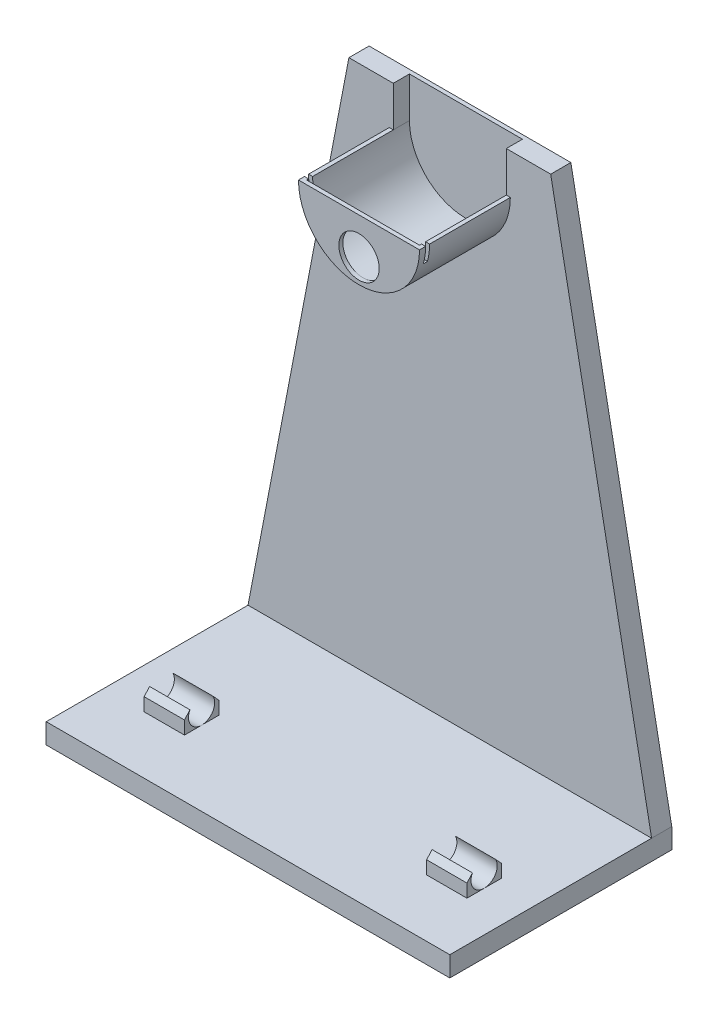
ISO-10303-21;
HEADER;
FILE_DESCRIPTION(('STEP AP214'),'2;1');
FILE_NAME('part.step','',(''),(''),'','','');
FILE_SCHEMA(('AUTOMOTIVE_DESIGN { 1 0 10303 214 1 1 1 1 }'));
ENDSEC;
DATA;
#1=APPLICATION_CONTEXT('core data for automotive mechanical design processes');
#2=APPLICATION_PROTOCOL_DEFINITION('international standard','automotive_design',2000,#1);
#3=PRODUCT_CONTEXT('',#1,'mechanical');
#4=PRODUCT('Part','Part','',(#3));
#5=PRODUCT_RELATED_PRODUCT_CATEGORY('part','',(#4));
#6=PRODUCT_DEFINITION_FORMATION('','',#4);
#7=PRODUCT_DEFINITION_CONTEXT('part definition',#1,'design');
#8=PRODUCT_DEFINITION('design','',#6,#7);
#9=PRODUCT_DEFINITION_SHAPE('','',#8);
#10=(LENGTH_UNIT() NAMED_UNIT(*) SI_UNIT(.MILLI.,.METRE.));
#11=(NAMED_UNIT(*) PLANE_ANGLE_UNIT() SI_UNIT($,.RADIAN.));
#12=(NAMED_UNIT(*) SI_UNIT($,.STERADIAN.) SOLID_ANGLE_UNIT());
#13=UNCERTAINTY_MEASURE_WITH_UNIT(LENGTH_MEASURE(1.E-05),#10,'distance_accuracy_value','');
#14=(GEOMETRIC_REPRESENTATION_CONTEXT(3) GLOBAL_UNCERTAINTY_ASSIGNED_CONTEXT((#13)) GLOBAL_UNIT_ASSIGNED_CONTEXT((#10,
#11,#12)) REPRESENTATION_CONTEXT('',''));
#15=CARTESIAN_POINT('',(0.,0.,0.));
#16=DIRECTION('',(0.,0.,1.));
#17=DIRECTION('',(1.,0.,0.));
#18=AXIS2_PLACEMENT_3D('',#15,#16,#17);
#19=CARTESIAN_POINT('',(-15.,120.,27.5));
#20=DIRECTION('',(0.,1.,0.));
#21=DIRECTION('',(0.,0.,1.));
#22=AXIS2_PLACEMENT_3D('',#19,#20,#21);
#23=PLANE('',#22);
#24=DIRECTION('',(-1.,0.,0.));
#25=VECTOR('',#24,1.);
#26=CARTESIAN_POINT('',(-20.1929042821755,120.,25.));
#27=LINE('',#26,#25);
#28=CARTESIAN_POINT('',(-14.,120.,25.));
#29=VERTEX_POINT('',#28);
#30=CARTESIAN_POINT('',(-15.,120.,25.));
#31=VERTEX_POINT('',#30);
#32=EDGE_CURVE('E442',#29,#31,#27,.T.);
#33=ORIENTED_EDGE('',*,*,#32,.F.);
#34=DIRECTION('',(0.,0.,-1.));
#35=VECTOR('',#34,1.);
#36=CARTESIAN_POINT('',(-14.,120.,26.5));
#37=LINE('',#36,#35);
#38=CARTESIAN_POINT('',(-14.,120.,5.));
#39=VERTEX_POINT('',#38);
#40=EDGE_CURVE('E522',#29,#39,#37,.T.);
#41=ORIENTED_EDGE('',*,*,#40,.T.);
#42=DIRECTION('',(1.,0.,0.));
#43=VECTOR('',#42,1.);
#44=CARTESIAN_POINT('',(-15.,120.,5.));
#45=LINE('',#44,#43);
#46=CARTESIAN_POINT('',(-15.,120.,5.));
#47=VERTEX_POINT('',#46);
#48=EDGE_CURVE('E548',#47,#39,#45,.T.);
#49=ORIENTED_EDGE('',*,*,#48,.F.);
#50=DIRECTION('',(0.,0.,-1.));
#51=VECTOR('',#50,1.);
#52=CARTESIAN_POINT('',(-15.,120.,27.5));
#53=LINE('',#52,#51);
#54=EDGE_CURVE('E552',#31,#47,#53,.T.);
#55=ORIENTED_EDGE('',*,*,#54,.F.);
#56=EDGE_LOOP('',(#33,#41,#49,#55));
#57=FACE_BOUND('',#56,.T.);
#58=ADVANCED_FACE('F45',(#57),#23,.T.);
#59=CARTESIAN_POINT('',(15.,120.,25.));
#60=VERTEX_POINT('',#59);
#61=CARTESIAN_POINT('',(14.,120.,25.));
#62=VERTEX_POINT('',#61);
#63=EDGE_CURVE('E445',#60,#62,#27,.T.);
#64=ORIENTED_EDGE('',*,*,#63,.F.);
#65=DIRECTION('',(0.,0.,-1.));
#66=VECTOR('',#65,1.);
#67=CARTESIAN_POINT('',(15.,120.,27.5));
#68=LINE('',#67,#66);
#69=CARTESIAN_POINT('',(15.,120.,5.));
#70=VERTEX_POINT('',#69);
#71=EDGE_CURVE('E564',#60,#70,#68,.T.);
#72=ORIENTED_EDGE('',*,*,#71,.T.);
#73=CARTESIAN_POINT('',(14.,120.,5.));
#74=VERTEX_POINT('',#73);
#75=EDGE_CURVE('E556',#74,#70,#45,.T.);
#76=ORIENTED_EDGE('',*,*,#75,.F.);
#77=DIRECTION('',(0.,0.,-1.));
#78=VECTOR('',#77,1.);
#79=CARTESIAN_POINT('',(14.,120.,26.5));
#80=LINE('',#79,#78);
#81=EDGE_CURVE('E535',#62,#74,#80,.T.);
#82=ORIENTED_EDGE('',*,*,#81,.F.);
#83=EDGE_LOOP('',(#64,#72,#76,#82));
#84=FACE_BOUND('',#83,.T.);
#85=ADVANCED_FACE('F728',(#84),#23,.T.);
#86=CARTESIAN_POINT('',(0.,0.,5.));
#87=DIRECTION('',(0.,0.,1.));
#88=DIRECTION('',(1.,0.,0.));
#89=AXIS2_PLACEMENT_3D('',#86,#87,#88);
#90=PLANE('',#89);
#91=DIRECTION('',(-0.188847393650124,-0.982006446980647,0.));
#92=VECTOR('',#91,1.);
#93=CARTESIAN_POINT('',(-25.,130.,5.));
#94=LINE('',#93,#92);
#95=CARTESIAN_POINT('',(-25.,130.,5.));
#96=VERTEX_POINT('',#95);
#97=CARTESIAN_POINT('',(-50.,0.,5.));
#98=VERTEX_POINT('',#97);
#99=EDGE_CURVE('E580',#96,#98,#94,.T.);
#100=ORIENTED_EDGE('',*,*,#99,.T.);
#101=DIRECTION('',(-1.,0.,0.));
#102=VECTOR('',#101,1.);
#103=CARTESIAN_POINT('',(50.,0.,5.));
#104=LINE('',#103,#102);
#105=CARTESIAN_POINT('',(50.,0.,5.));
#106=VERTEX_POINT('',#105);
#107=EDGE_CURVE('E477',#106,#98,#104,.T.);
#108=ORIENTED_EDGE('',*,*,#107,.F.);
#109=DIRECTION('',(-0.188847393650124,0.982006446980647,0.));
#110=VECTOR('',#109,1.);
#111=CARTESIAN_POINT('',(25.,130.,5.));
#112=LINE('',#111,#110);
#113=CARTESIAN_POINT('',(25.,130.,5.));
#114=VERTEX_POINT('',#113);
#115=EDGE_CURVE('E570',#106,#114,#112,.T.);
#116=ORIENTED_EDGE('',*,*,#115,.T.);
#117=DIRECTION('',(-1.,0.,0.));
#118=VECTOR('',#117,1.);
#119=CARTESIAN_POINT('',(25.,130.,5.));
#120=LINE('',#119,#118);
#121=CARTESIAN_POINT('',(14.,130.,5.));
#122=VERTEX_POINT('',#121);
#123=EDGE_CURVE('E576',#114,#122,#120,.T.);
#124=ORIENTED_EDGE('',*,*,#123,.T.);
#125=DIRECTION('',(0.,-1.,0.));
#126=VECTOR('',#125,1.);
#127=CARTESIAN_POINT('',(14.,0.,5.));
#128=LINE('',#127,#126);
#129=EDGE_CURVE('E539',#122,#74,#128,.T.);
#130=ORIENTED_EDGE('',*,*,#129,.T.);
#131=ORIENTED_EDGE('',*,*,#75,.T.);
#132=CARTESIAN_POINT('',(0.,120.,5.));
#133=DIRECTION('',(0.,0.,1.));
#134=DIRECTION('',(1.,0.,0.));
#135=AXIS2_PLACEMENT_3D('',#132,#133,#134);
#136=CIRCLE('',#135,15.);
#137=EDGE_CURVE('E543',#47,#70,#136,.T.);
#138=ORIENTED_EDGE('',*,*,#137,.F.);
#139=ORIENTED_EDGE('',*,*,#48,.T.);
#140=DIRECTION('',(0.,1.,0.));
#141=VECTOR('',#140,1.);
#142=CARTESIAN_POINT('',(-14.,0.,5.));
#143=LINE('',#142,#141);
#144=CARTESIAN_POINT('',(-14.,130.,5.));
#145=VERTEX_POINT('',#144);
#146=EDGE_CURVE('E534',#39,#145,#143,.T.);
#147=ORIENTED_EDGE('',*,*,#146,.T.);
#148=EDGE_CURVE('E574',#145,#96,#120,.T.);
#149=ORIENTED_EDGE('',*,*,#148,.T.);
#150=EDGE_LOOP('',(#100,#108,#116,#124,#130,#131,#138,#139,#147,#149));
#151=FACE_BOUND('',#150,.T.);
#152=ADVANCED_FACE('F735',(#151),#90,.T.);
#153=CARTESIAN_POINT('',(25.,130.,5.));
#154=DIRECTION('',(0.,-1.,0.));
#155=DIRECTION('',(1.,0.,0.));
#156=AXIS2_PLACEMENT_3D('',#153,#154,#155);
#157=PLANE('',#156);
#158=DIRECTION('',(0.,0.,-1.));
#159=VECTOR('',#158,1.);
#160=CARTESIAN_POINT('',(14.,130.,26.5));
#161=LINE('',#160,#159);
#162=CARTESIAN_POINT('',(14.,130.,1.));
#163=VERTEX_POINT('',#162);
#164=EDGE_CURVE('E526',#122,#163,#161,.T.);
#165=ORIENTED_EDGE('',*,*,#164,.F.);
#166=ORIENTED_EDGE('',*,*,#123,.F.);
#167=DIRECTION('',(0.,0.,-1.));
#168=VECTOR('',#167,1.);
#169=CARTESIAN_POINT('',(25.,130.,5.));
#170=LINE('',#169,#168);
#171=CARTESIAN_POINT('',(25.,130.,0.));
#172=VERTEX_POINT('',#171);
#173=EDGE_CURVE('E621',#114,#172,#170,.T.);
#174=ORIENTED_EDGE('',*,*,#173,.T.);
#175=DIRECTION('',(-1.,0.,0.));
#176=VECTOR('',#175,1.);
#177=CARTESIAN_POINT('',(25.,130.,0.));
#178=LINE('',#177,#176);
#179=CARTESIAN_POINT('',(-25.,130.,0.));
#180=VERTEX_POINT('',#179);
#181=EDGE_CURVE('E588',#172,#180,#178,.T.);
#182=ORIENTED_EDGE('',*,*,#181,.T.);
#183=DIRECTION('',(0.,0.,-1.));
#184=VECTOR('',#183,1.);
#185=CARTESIAN_POINT('',(-25.,130.,5.));
#186=LINE('',#185,#184);
#187=EDGE_CURVE('E617',#96,#180,#186,.T.);
#188=ORIENTED_EDGE('',*,*,#187,.F.);
#189=ORIENTED_EDGE('',*,*,#148,.F.);
#190=DIRECTION('',(0.,0.,-1.));
#191=VECTOR('',#190,1.);
#192=CARTESIAN_POINT('',(-14.,130.,26.5));
#193=LINE('',#192,#191);
#194=CARTESIAN_POINT('',(-14.,130.,1.));
#195=VERTEX_POINT('',#194);
#196=EDGE_CURVE('E521',#145,#195,#193,.T.);
#197=ORIENTED_EDGE('',*,*,#196,.T.);
#198=DIRECTION('',(-1.,0.,0.));
#199=VECTOR('',#198,1.);
#200=CARTESIAN_POINT('',(-14.,130.,1.));
#201=LINE('',#200,#199);
#202=EDGE_CURVE('E504',#163,#195,#201,.T.);
#203=ORIENTED_EDGE('',*,*,#202,.F.);
#204=EDGE_LOOP('',(#165,#166,#174,#182,#188,#189,#197,#203));
#205=FACE_BOUND('',#204,.T.);
#206=ADVANCED_FACE('F740',(#205),#157,.F.);
#207=DIRECTION('',(1.,0.,0.));
#208=VECTOR('',#207,1.);
#209=CARTESIAN_POINT('',(21.4474135279385,120.,26.));
#210=LINE('',#209,#208);
#211=CARTESIAN_POINT('',(-15.,120.,26.));
#212=VERTEX_POINT('',#211);
#213=CARTESIAN_POINT('',(-14.,120.,26.));
#214=VERTEX_POINT('',#213);
#215=EDGE_CURVE('E436',#212,#214,#210,.T.);
#216=ORIENTED_EDGE('',*,*,#215,.F.);
#217=CARTESIAN_POINT('',(-15.,120.,27.5));
#218=VERTEX_POINT('',#217);
#219=EDGE_CURVE('E560',#218,#212,#53,.T.);
#220=ORIENTED_EDGE('',*,*,#219,.F.);
#221=DIRECTION('',(1.,0.,0.));
#222=VECTOR('',#221,1.);
#223=CARTESIAN_POINT('',(-15.,120.,27.5));
#224=LINE('',#223,#222);
#225=CARTESIAN_POINT('',(15.,120.,27.5));
#226=VERTEX_POINT('',#225);
#227=EDGE_CURVE('E547',#218,#226,#224,.T.);
#228=ORIENTED_EDGE('',*,*,#227,.T.);
#229=CARTESIAN_POINT('',(15.,120.,26.));
#230=VERTEX_POINT('',#229);
#231=EDGE_CURVE('E565',#226,#230,#68,.T.);
#232=ORIENTED_EDGE('',*,*,#231,.T.);
#233=CARTESIAN_POINT('',(14.,120.,26.));
#234=VERTEX_POINT('',#233);
#235=EDGE_CURVE('E446',#234,#230,#210,.T.);
#236=ORIENTED_EDGE('',*,*,#235,.F.);
#237=CARTESIAN_POINT('',(14.,120.,26.5));
#238=VERTEX_POINT('',#237);
#239=EDGE_CURVE('E530',#238,#234,#80,.T.);
#240=ORIENTED_EDGE('',*,*,#239,.F.);
#241=DIRECTION('',(1.,0.,0.));
#242=VECTOR('',#241,1.);
#243=CARTESIAN_POINT('',(-15.,120.,26.5));
#244=LINE('',#243,#242);
#245=CARTESIAN_POINT('',(-14.,120.,26.5));
#246=VERTEX_POINT('',#245);
#247=EDGE_CURVE('E625',#246,#238,#244,.T.);
#248=ORIENTED_EDGE('',*,*,#247,.F.);
#249=EDGE_CURVE('E517',#246,#214,#37,.T.);
#250=ORIENTED_EDGE('',*,*,#249,.T.);
#251=EDGE_LOOP('',(#216,#220,#228,#232,#236,#240,#248,#250));
#252=FACE_BOUND('',#251,.T.);
#253=ADVANCED_FACE('F730',(#252),#23,.T.);
#254=CARTESIAN_POINT('',(25.,130.,5.));
#255=DIRECTION('',(-0.982006446980647,-0.188847393650124,0.));
#256=DIRECTION('',(0.188847393650124,-0.982006446980648,0.));
#257=AXIS2_PLACEMENT_3D('',#254,#255,#256);
#258=PLANE('',#257);
#259=DIRECTION('',(-0.188847393650124,0.982006446980647,0.));
#260=VECTOR('',#259,1.);
#261=CARTESIAN_POINT('',(25.,130.,0.));
#262=LINE('',#261,#260);
#263=CARTESIAN_POINT('',(50.,0.,0.));
#264=VERTEX_POINT('',#263);
#265=EDGE_CURVE('E569',#264,#172,#262,.T.);
#266=ORIENTED_EDGE('',*,*,#265,.T.);
#267=ORIENTED_EDGE('',*,*,#173,.F.);
#268=ORIENTED_EDGE('',*,*,#115,.F.);
#269=DIRECTION('',(0.,0.,-1.));
#270=VECTOR('',#269,1.);
#271=CARTESIAN_POINT('',(50.,0.,5.));
#272=LINE('',#271,#270);
#273=EDGE_CURVE('E584',#106,#264,#272,.T.);
#274=ORIENTED_EDGE('',*,*,#273,.T.);
#275=EDGE_LOOP('',(#266,#267,#268,#274));
#276=FACE_BOUND('',#275,.T.);
#277=ADVANCED_FACE('F47',(#276),#258,.F.);
#278=CARTESIAN_POINT('',(-25.,130.,5.));
#279=DIRECTION('',(0.982006446980647,-0.188847393650124,0.));
#280=DIRECTION('',(0.188847393650124,0.982006446980648,0.));
#281=AXIS2_PLACEMENT_3D('',#278,#279,#280);
#282=PLANE('',#281);
#283=DIRECTION('',(-0.188847393650124,-0.982006446980647,0.));
#284=VECTOR('',#283,1.);
#285=CARTESIAN_POINT('',(-25.,130.,0.));
#286=LINE('',#285,#284);
#287=CARTESIAN_POINT('',(-50.,0.,0.));
#288=VERTEX_POINT('',#287);
#289=EDGE_CURVE('E591',#180,#288,#286,.T.);
#290=ORIENTED_EDGE('',*,*,#289,.T.);
#291=DIRECTION('',(0.,0.,-1.));
#292=VECTOR('',#291,1.);
#293=CARTESIAN_POINT('',(-50.,0.,5.));
#294=LINE('',#293,#292);
#295=EDGE_CURVE('E613',#98,#288,#294,.T.);
#296=ORIENTED_EDGE('',*,*,#295,.F.);
#297=ORIENTED_EDGE('',*,*,#99,.F.);
#298=ORIENTED_EDGE('',*,*,#187,.T.);
#299=EDGE_LOOP('',(#290,#296,#297,#298));
#300=FACE_BOUND('',#299,.T.);
#301=ADVANCED_FACE('F746',(#300),#282,.F.);
#302=CARTESIAN_POINT('',(-50.,0.,5.));
#303=DIRECTION('',(1.,0.,0.));
#304=DIRECTION('',(0.,0.,-1.));
#305=AXIS2_PLACEMENT_3D('',#302,#303,#304);
#306=PLANE('',#305);
#307=DIRECTION('',(0.,-1.,0.));
#308=VECTOR('',#307,1.);
#309=CARTESIAN_POINT('',(-50.,0.,0.));
#310=LINE('',#309,#308);
#311=CARTESIAN_POINT('',(-50.,-5.,0.));
#312=VERTEX_POINT('',#311);
#313=EDGE_CURVE('E594',#288,#312,#310,.T.);
#314=ORIENTED_EDGE('',*,*,#313,.T.);
#315=DIRECTION('',(0.,0.,-1.));
#316=VECTOR('',#315,1.);
#317=CARTESIAN_POINT('',(-50.,-5.,5.));
#318=LINE('',#317,#316);
#319=CARTESIAN_POINT('',(-50.,-5.,55.));
#320=VERTEX_POINT('',#319);
#321=EDGE_CURVE('E609',#320,#312,#318,.T.);
#322=ORIENTED_EDGE('',*,*,#321,.F.);
#323=DIRECTION('',(0.,-1.,0.));
#324=VECTOR('',#323,1.);
#325=CARTESIAN_POINT('',(-50.,0.,55.));
#326=LINE('',#325,#324);
#327=CARTESIAN_POINT('',(-50.,0.,55.));
#328=VERTEX_POINT('',#327);
#329=EDGE_CURVE('E472',#328,#320,#326,.T.);
#330=ORIENTED_EDGE('',*,*,#329,.F.);
#331=DIRECTION('',(0.,0.,-1.));
#332=VECTOR('',#331,1.);
#333=CARTESIAN_POINT('',(-50.,0.,55.));
#334=LINE('',#333,#332);
#335=EDGE_CURVE('E486',#328,#98,#334,.T.);
#336=ORIENTED_EDGE('',*,*,#335,.T.);
#337=ORIENTED_EDGE('',*,*,#295,.T.);
#338=EDGE_LOOP('',(#314,#322,#330,#336,#337));
#339=FACE_BOUND('',#338,.T.);
#340=ADVANCED_FACE('F823',(#339),#306,.F.);
#341=CARTESIAN_POINT('',(-50.,-5.,5.));
#342=DIRECTION('',(0.,1.,0.));
#343=DIRECTION('',(0.,0.,1.));
#344=AXIS2_PLACEMENT_3D('',#341,#342,#343);
#345=PLANE('',#344);
#346=DIRECTION('',(0.,0.,-1.));
#347=VECTOR('',#346,1.);
#348=CARTESIAN_POINT('',(50.,-5.,5.));
#349=LINE('',#348,#347);
#350=CARTESIAN_POINT('',(50.,-5.,55.));
#351=VERTEX_POINT('',#350);
#352=CARTESIAN_POINT('',(50.,-5.,0.));
#353=VERTEX_POINT('',#352);
#354=EDGE_CURVE('E605',#351,#353,#349,.T.);
#355=ORIENTED_EDGE('',*,*,#354,.F.);
#356=DIRECTION('',(1.,0.,0.));
#357=VECTOR('',#356,1.);
#358=CARTESIAN_POINT('',(-50.,-5.,55.));
#359=LINE('',#358,#357);
#360=EDGE_CURVE('E476',#320,#351,#359,.T.);
#361=ORIENTED_EDGE('',*,*,#360,.F.);
#362=ORIENTED_EDGE('',*,*,#321,.T.);
#363=DIRECTION('',(1.,0.,0.));
#364=VECTOR('',#363,1.);
#365=CARTESIAN_POINT('',(-50.,-5.,0.));
#366=LINE('',#365,#364);
#367=EDGE_CURVE('E597',#312,#353,#366,.T.);
#368=ORIENTED_EDGE('',*,*,#367,.T.);
#369=EDGE_LOOP('',(#355,#361,#362,#368));
#370=FACE_BOUND('',#369,.T.);
#371=ADVANCED_FACE('F819',(#370),#345,.F.);
#372=CARTESIAN_POINT('',(50.,0.,5.));
#373=DIRECTION('',(-1.,0.,0.));
#374=DIRECTION('',(0.,0.,1.));
#375=AXIS2_PLACEMENT_3D('',#372,#373,#374);
#376=PLANE('',#375);
#377=DIRECTION('',(0.,1.,0.));
#378=VECTOR('',#377,1.);
#379=CARTESIAN_POINT('',(50.,0.,0.));
#380=LINE('',#379,#378);
#381=EDGE_CURVE('E575',#353,#264,#380,.T.);
#382=ORIENTED_EDGE('',*,*,#381,.T.);
#383=ORIENTED_EDGE('',*,*,#273,.F.);
#384=DIRECTION('',(0.,0.,-1.));
#385=VECTOR('',#384,1.);
#386=CARTESIAN_POINT('',(50.,0.,55.));
#387=LINE('',#386,#385);
#388=CARTESIAN_POINT('',(50.,0.,55.));
#389=VERTEX_POINT('',#388);
#390=EDGE_CURVE('E492',#389,#106,#387,.T.);
#391=ORIENTED_EDGE('',*,*,#390,.F.);
#392=DIRECTION('',(0.,1.,0.));
#393=VECTOR('',#392,1.);
#394=CARTESIAN_POINT('',(50.,-5.,55.));
#395=LINE('',#394,#393);
#396=EDGE_CURVE('E480',#351,#389,#395,.T.);
#397=ORIENTED_EDGE('',*,*,#396,.F.);
#398=ORIENTED_EDGE('',*,*,#354,.T.);
#399=EDGE_LOOP('',(#382,#383,#391,#397,#398));
#400=FACE_BOUND('',#399,.T.);
#401=ADVANCED_FACE('F811',(#400),#376,.F.);
#402=CARTESIAN_POINT('',(0.,0.,0.));
#403=DIRECTION('',(0.,0.,1.));
#404=DIRECTION('',(1.,0.,0.));
#405=AXIS2_PLACEMENT_3D('',#402,#403,#404);
#406=PLANE('',#405);
#407=ORIENTED_EDGE('',*,*,#381,.F.);
#408=ORIENTED_EDGE('',*,*,#367,.F.);
#409=ORIENTED_EDGE('',*,*,#313,.F.);
#410=ORIENTED_EDGE('',*,*,#289,.F.);
#411=ORIENTED_EDGE('',*,*,#181,.F.);
#412=ORIENTED_EDGE('',*,*,#265,.F.);
#413=EDGE_LOOP('',(#407,#408,#409,#410,#411,#412));
#414=FACE_BOUND('',#413,.T.);
#415=ADVANCED_FACE('F806',(#414),#406,.F.);
#416=CARTESIAN_POINT('',(0.,120.,27.5));
#417=DIRECTION('',(0.,0.,-1.));
#418=DIRECTION('',(-1.,0.,0.));
#419=AXIS2_PLACEMENT_3D('',#416,#417,#418);
#420=CYLINDRICAL_SURFACE('',#419,15.);
#421=DIRECTION('',(0.,0.,-1.));
#422=VECTOR('',#421,1.);
#423=CARTESIAN_POINT('',(-14.456832294801,116.,27.5));
#424=LINE('',#423,#422);
#425=CARTESIAN_POINT('',(-14.456832294801,116.,26.));
#426=VERTEX_POINT('',#425);
#427=CARTESIAN_POINT('',(-14.456832294801,116.,25.));
#428=VERTEX_POINT('',#427);
#429=EDGE_CURVE('E453',#426,#428,#424,.T.);
#430=ORIENTED_EDGE('',*,*,#429,.T.);
#431=CARTESIAN_POINT('',(0.,120.,25.));
#432=DIRECTION('',(0.,0.,-1.));
#433=DIRECTION('',(-1.,0.,0.));
#434=AXIS2_PLACEMENT_3D('',#431,#432,#433);
#435=CIRCLE('',#434,15.);
#436=EDGE_CURVE('E462',#428,#31,#435,.T.);
#437=ORIENTED_EDGE('',*,*,#436,.T.);
#438=ORIENTED_EDGE('',*,*,#54,.T.);
#439=ORIENTED_EDGE('',*,*,#137,.T.);
#440=ORIENTED_EDGE('',*,*,#71,.F.);
#441=CARTESIAN_POINT('',(14.456832294801,116.,25.));
#442=VERTEX_POINT('',#441);
#443=EDGE_CURVE('E466',#60,#442,#435,.T.);
#444=ORIENTED_EDGE('',*,*,#443,.T.);
#445=DIRECTION('',(0.,0.,-1.));
#446=VECTOR('',#445,1.);
#447=CARTESIAN_POINT('',(14.456832294801,116.,27.5));
#448=LINE('',#447,#446);
#449=CARTESIAN_POINT('',(14.456832294801,116.,26.));
#450=VERTEX_POINT('',#449);
#451=EDGE_CURVE('E449',#442,#450,#448,.F.);
#452=ORIENTED_EDGE('',*,*,#451,.T.);
#453=CARTESIAN_POINT('',(0.,120.,26.));
#454=DIRECTION('',(0.,0.,1.));
#455=DIRECTION('',(1.,0.,0.));
#456=AXIS2_PLACEMENT_3D('',#453,#454,#455);
#457=CIRCLE('',#456,15.);
#458=EDGE_CURVE('E457',#450,#230,#457,.T.);
#459=ORIENTED_EDGE('',*,*,#458,.T.);
#460=ORIENTED_EDGE('',*,*,#231,.F.);
#461=CARTESIAN_POINT('',(0.,120.,27.5));
#462=DIRECTION('',(0.,0.,1.));
#463=DIRECTION('',(1.,0.,0.));
#464=AXIS2_PLACEMENT_3D('',#461,#462,#463);
#465=CIRCLE('',#464,15.);
#466=EDGE_CURVE('E544',#218,#226,#465,.T.);
#467=ORIENTED_EDGE('',*,*,#466,.F.);
#468=ORIENTED_EDGE('',*,*,#219,.T.);
#469=EDGE_CURVE('E461',#212,#426,#457,.T.);
#470=ORIENTED_EDGE('',*,*,#469,.T.);
#471=EDGE_LOOP('',(#430,#437,#438,#439,#440,#444,#452,#459,#460,#467,#468,#470));
#472=FACE_BOUND('',#471,.T.);
#473=ADVANCED_FACE('F752',(#472),#420,.T.);
#474=CARTESIAN_POINT('',(0.,120.,27.5));
#475=DIRECTION('',(0.,0.,1.));
#476=DIRECTION('',(1.,0.,0.));
#477=AXIS2_PLACEMENT_3D('',#474,#475,#476);
#478=PLANE('',#477);
#479=CARTESIAN_POINT('',(0.,111.,27.5));
#480=DIRECTION('',(0.,0.,1.));
#481=DIRECTION('',(1.,0.,0.));
#482=AXIS2_PLACEMENT_3D('',#479,#480,#481);
#483=CIRCLE('',#482,5.);
#484=CARTESIAN_POINT('',(5.,111.,27.5));
#485=VERTEX_POINT('',#484);
#486=EDGE_CURVE('E467',#485,#485,#483,.T.);
#487=ORIENTED_EDGE('',*,*,#486,.F.);
#488=EDGE_LOOP('',(#487));
#489=FACE_BOUND('',#488,.T.);
#490=ORIENTED_EDGE('',*,*,#466,.T.);
#491=ORIENTED_EDGE('',*,*,#227,.F.);
#492=EDGE_LOOP('',(#490,#491));
#493=FACE_BOUND('',#492,.T.);
#494=ADVANCED_FACE('F756',(#489,#493),#478,.T.);
#495=CARTESIAN_POINT('',(0.,120.,26.5));
#496=DIRECTION('',(0.,0.,-1.));
#497=DIRECTION('',(-1.,0.,0.));
#498=AXIS2_PLACEMENT_3D('',#495,#496,#497);
#499=CYLINDRICAL_SURFACE('',#498,14.);
#500=CARTESIAN_POINT('',(0.,120.,25.));
#501=DIRECTION('',(0.,0.,-1.));
#502=DIRECTION('',(-1.,0.,0.));
#503=AXIS2_PLACEMENT_3D('',#500,#501,#502);
#504=CIRCLE('',#503,14.);
#505=CARTESIAN_POINT('',(-13.4164078649987,116.,25.));
#506=VERTEX_POINT('',#505);
#507=EDGE_CURVE('E11',#506,#29,#504,.T.);
#508=ORIENTED_EDGE('',*,*,#507,.F.);
#509=DIRECTION('',(0.,0.,-1.));
#510=VECTOR('',#509,1.);
#511=CARTESIAN_POINT('',(-13.4164078649987,116.,26.5));
#512=LINE('',#511,#510);
#513=CARTESIAN_POINT('',(-13.4164078649987,116.,26.));
#514=VERTEX_POINT('',#513);
#515=EDGE_CURVE('E49',#514,#506,#512,.T.);
#516=ORIENTED_EDGE('',*,*,#515,.F.);
#517=CARTESIAN_POINT('',(0.,120.,26.));
#518=DIRECTION('',(0.,0.,1.));
#519=DIRECTION('',(1.,0.,0.));
#520=AXIS2_PLACEMENT_3D('',#517,#518,#519);
#521=CIRCLE('',#520,14.);
#522=EDGE_CURVE('E55',#214,#514,#521,.T.);
#523=ORIENTED_EDGE('',*,*,#522,.F.);
#524=ORIENTED_EDGE('',*,*,#249,.F.);
#525=CARTESIAN_POINT('',(0.,120.,26.5));
#526=DIRECTION('',(0.,0.,1.));
#527=DIRECTION('',(1.,0.,0.));
#528=AXIS2_PLACEMENT_3D('',#525,#526,#527);
#529=CIRCLE('',#528,14.);
#530=CARTESIAN_POINT('',(0.,106.,26.5));
#531=VERTEX_POINT('',#530);
#532=EDGE_CURVE('E512',#246,#531,#529,.T.);
#533=ORIENTED_EDGE('',*,*,#532,.T.);
#534=EDGE_CURVE('E511',#531,#238,#529,.T.);
#535=ORIENTED_EDGE('',*,*,#534,.T.);
#536=ORIENTED_EDGE('',*,*,#239,.T.);
#537=CARTESIAN_POINT('',(13.4164078649987,116.,26.));
#538=VERTEX_POINT('',#537);
#539=EDGE_CURVE('E635',#538,#234,#521,.T.);
#540=ORIENTED_EDGE('',*,*,#539,.F.);
#541=DIRECTION('',(0.,0.,-1.));
#542=VECTOR('',#541,1.);
#543=CARTESIAN_POINT('',(13.4164078649987,116.,26.5));
#544=LINE('',#543,#542);
#545=CARTESIAN_POINT('',(13.4164078649987,116.,25.));
#546=VERTEX_POINT('',#545);
#547=EDGE_CURVE('E629',#546,#538,#544,.F.);
#548=ORIENTED_EDGE('',*,*,#547,.F.);
#549=EDGE_CURVE('E56',#62,#546,#504,.T.);
#550=ORIENTED_EDGE('',*,*,#549,.F.);
#551=ORIENTED_EDGE('',*,*,#81,.T.);
#552=CARTESIAN_POINT('',(14.,120.,1.));
#553=VERTEX_POINT('',#552);
#554=EDGE_CURVE('E529',#74,#553,#80,.T.);
#555=ORIENTED_EDGE('',*,*,#554,.T.);
#556=CARTESIAN_POINT('',(0.,120.,1.));
#557=DIRECTION('',(0.,0.,1.));
#558=DIRECTION('',(1.,0.,0.));
#559=AXIS2_PLACEMENT_3D('',#556,#557,#558);
#560=CIRCLE('',#559,14.);
#561=CARTESIAN_POINT('',(-14.,120.,1.));
#562=VERTEX_POINT('',#561);
#563=EDGE_CURVE('E496',#562,#553,#560,.T.);
#564=ORIENTED_EDGE('',*,*,#563,.F.);
#565=EDGE_CURVE('E516',#39,#562,#37,.T.);
#566=ORIENTED_EDGE('',*,*,#565,.F.);
#567=ORIENTED_EDGE('',*,*,#40,.F.);
#568=EDGE_LOOP('',(#508,#516,#523,#524,#533,#535,#536,#540,#548,#550,#551,#555,#564,#566,#567));
#569=FACE_BOUND('',#568,.T.);
#570=ADVANCED_FACE('F658',(#569),#499,.F.);
#571=CARTESIAN_POINT('',(14.,130.,26.5));
#572=DIRECTION('',(-1.,0.,0.));
#573=DIRECTION('',(0.,0.,1.));
#574=AXIS2_PLACEMENT_3D('',#571,#572,#573);
#575=PLANE('',#574);
#576=ORIENTED_EDGE('',*,*,#164,.T.);
#577=DIRECTION('',(0.,1.,0.));
#578=VECTOR('',#577,1.);
#579=CARTESIAN_POINT('',(14.,130.,1.));
#580=LINE('',#579,#578);
#581=EDGE_CURVE('E500',#553,#163,#580,.T.);
#582=ORIENTED_EDGE('',*,*,#581,.F.);
#583=ORIENTED_EDGE('',*,*,#554,.F.);
#584=ORIENTED_EDGE('',*,*,#129,.F.);
#585=EDGE_LOOP('',(#576,#582,#583,#584));
#586=FACE_BOUND('',#585,.T.);
#587=ADVANCED_FACE('F795',(#586),#575,.T.);
#588=CARTESIAN_POINT('',(-14.,120.,26.5));
#589=DIRECTION('',(1.,0.,0.));
#590=DIRECTION('',(0.,0.,-1.));
#591=AXIS2_PLACEMENT_3D('',#588,#589,#590);
#592=PLANE('',#591);
#593=ORIENTED_EDGE('',*,*,#565,.T.);
#594=DIRECTION('',(0.,-1.,0.));
#595=VECTOR('',#594,1.);
#596=CARTESIAN_POINT('',(-14.,120.,1.));
#597=LINE('',#596,#595);
#598=EDGE_CURVE('E507',#195,#562,#597,.T.);
#599=ORIENTED_EDGE('',*,*,#598,.F.);
#600=ORIENTED_EDGE('',*,*,#196,.F.);
#601=ORIENTED_EDGE('',*,*,#146,.F.);
#602=EDGE_LOOP('',(#593,#599,#600,#601));
#603=FACE_BOUND('',#602,.T.);
#604=ADVANCED_FACE('F792',(#603),#592,.T.);
#605=CARTESIAN_POINT('',(0.,120.,26.5));
#606=DIRECTION('',(0.,0.,1.));
#607=DIRECTION('',(1.,0.,0.));
#608=AXIS2_PLACEMENT_3D('',#605,#606,#607);
#609=PLANE('',#608);
#610=ORIENTED_EDGE('',*,*,#534,.F.);
#611=CARTESIAN_POINT('',(0.,111.,26.5));
#612=DIRECTION('',(0.,0.,1.));
#613=DIRECTION('',(1.,0.,0.));
#614=AXIS2_PLACEMENT_3D('',#611,#612,#613);
#615=CIRCLE('',#614,5.);
#616=EDGE_CURVE('E471',#531,#531,#615,.T.);
#617=ORIENTED_EDGE('',*,*,#616,.T.);
#618=ORIENTED_EDGE('',*,*,#532,.F.);
#619=ORIENTED_EDGE('',*,*,#247,.T.);
#620=EDGE_LOOP('',(#610,#617,#618,#619));
#621=FACE_BOUND('',#620,.T.);
#622=ADVANCED_FACE('F763',(#621),#609,.F.);
#623=CARTESIAN_POINT('',(0.,120.,1.));
#624=DIRECTION('',(0.,0.,1.));
#625=DIRECTION('',(1.,0.,0.));
#626=AXIS2_PLACEMENT_3D('',#623,#624,#625);
#627=PLANE('',#626);
#628=ORIENTED_EDGE('',*,*,#563,.T.);
#629=ORIENTED_EDGE('',*,*,#581,.T.);
#630=ORIENTED_EDGE('',*,*,#202,.T.);
#631=ORIENTED_EDGE('',*,*,#598,.T.);
#632=EDGE_LOOP('',(#628,#629,#630,#631));
#633=FACE_BOUND('',#632,.T.);
#634=ADVANCED_FACE('F787',(#633),#627,.T.);
#635=CARTESIAN_POINT('',(50.,0.,55.));
#636=DIRECTION('',(0.,-1.,0.));
#637=DIRECTION('',(0.,0.,-1.));
#638=AXIS2_PLACEMENT_3D('',#635,#636,#637);
#639=PLANE('',#638);
#640=DIRECTION('',(0.,0.,1.));
#641=VECTOR('',#640,1.);
#642=CARTESIAN_POINT('',(30.,0.,55.));
#643=LINE('',#642,#641);
#644=CARTESIAN_POINT('',(30.,0.,32.2499999999996));
#645=VERTEX_POINT('',#644);
#646=CARTESIAN_POINT('',(30.,0.,36.4999999999996));
#647=VERTEX_POINT('',#646);
#648=EDGE_CURVE('E362',#645,#647,#643,.T.);
#649=ORIENTED_EDGE('',*,*,#648,.F.);
#650=DIRECTION('',(1.,0.,0.));
#651=VECTOR('',#650,1.);
#652=CARTESIAN_POINT('',(30.,0.,32.2499999999996));
#653=LINE('',#652,#651);
#654=CARTESIAN_POINT('',(40.,0.,32.2499999999996));
#655=VERTEX_POINT('',#654);
#656=EDGE_CURVE('E347',#645,#655,#653,.T.);
#657=ORIENTED_EDGE('',*,*,#656,.T.);
#658=DIRECTION('',(0.,0.,1.));
#659=VECTOR('',#658,1.);
#660=CARTESIAN_POINT('',(40.,0.,55.));
#661=LINE('',#660,#659);
#662=CARTESIAN_POINT('',(40.,0.,36.4999999999996));
#663=VERTEX_POINT('',#662);
#664=EDGE_CURVE('E358',#655,#663,#661,.T.);
#665=ORIENTED_EDGE('',*,*,#664,.T.);
#666=CARTESIAN_POINT('',(40.,0.,40.7499999999996));
#667=VERTEX_POINT('',#666);
#668=EDGE_CURVE('E289',#663,#667,#661,.T.);
#669=ORIENTED_EDGE('',*,*,#668,.T.);
#670=DIRECTION('',(1.,0.,0.));
#671=VECTOR('',#670,1.);
#672=CARTESIAN_POINT('',(30.,0.,40.7499999999996));
#673=LINE('',#672,#671);
#674=CARTESIAN_POINT('',(30.,0.,40.7499999999996));
#675=VERTEX_POINT('',#674);
#676=EDGE_CURVE('E351',#675,#667,#673,.T.);
#677=ORIENTED_EDGE('',*,*,#676,.F.);
#678=EDGE_CURVE('E359',#647,#675,#643,.T.);
#679=ORIENTED_EDGE('',*,*,#678,.F.);
#680=EDGE_LOOP('',(#649,#657,#665,#669,#677,#679));
#681=FACE_BOUND('',#680,.T.);
#682=ORIENTED_EDGE('',*,*,#107,.T.);
#683=ORIENTED_EDGE('',*,*,#335,.F.);
#684=DIRECTION('',(-1.,0.,0.));
#685=VECTOR('',#684,1.);
#686=CARTESIAN_POINT('',(50.,0.,55.));
#687=LINE('',#686,#685);
#688=EDGE_CURVE('E483',#389,#328,#687,.T.);
#689=ORIENTED_EDGE('',*,*,#688,.F.);
#690=ORIENTED_EDGE('',*,*,#390,.T.);
#691=EDGE_LOOP('',(#682,#683,#689,#690));
#692=FACE_BOUND('',#691,.T.);
#693=DIRECTION('',(0.,0.,1.));
#694=VECTOR('',#693,1.);
#695=CARTESIAN_POINT('',(-40.,0.,55.));
#696=LINE('',#695,#694);
#697=CARTESIAN_POINT('',(-40.,0.,32.2499999999996));
#698=VERTEX_POINT('',#697);
#699=CARTESIAN_POINT('',(-40.,0.,36.4999999999996));
#700=VERTEX_POINT('',#699);
#701=EDGE_CURVE('E430',#698,#700,#696,.T.);
#702=ORIENTED_EDGE('',*,*,#701,.F.);
#703=DIRECTION('',(1.,0.,0.));
#704=VECTOR('',#703,1.);
#705=CARTESIAN_POINT('',(-40.,0.,32.2499999999996));
#706=LINE('',#705,#704);
#707=CARTESIAN_POINT('',(-30.,0.,32.2499999999996));
#708=VERTEX_POINT('',#707);
#709=EDGE_CURVE('E410',#698,#708,#706,.T.);
#710=ORIENTED_EDGE('',*,*,#709,.T.);
#711=DIRECTION('',(0.,0.,1.));
#712=VECTOR('',#711,1.);
#713=CARTESIAN_POINT('',(-30.,0.,55.));
#714=LINE('',#713,#712);
#715=CARTESIAN_POINT('',(-30.,0.,36.4999999999996));
#716=VERTEX_POINT('',#715);
#717=EDGE_CURVE('E426',#708,#716,#714,.T.);
#718=ORIENTED_EDGE('',*,*,#717,.T.);
#719=CARTESIAN_POINT('',(-30.,0.,40.7499999999996));
#720=VERTEX_POINT('',#719);
#721=EDGE_CURVE('E406',#716,#720,#714,.T.);
#722=ORIENTED_EDGE('',*,*,#721,.T.);
#723=DIRECTION('',(1.,0.,0.));
#724=VECTOR('',#723,1.);
#725=CARTESIAN_POINT('',(-40.,0.,40.7499999999996));
#726=LINE('',#725,#724);
#727=CARTESIAN_POINT('',(-40.,0.,40.7499999999996));
#728=VERTEX_POINT('',#727);
#729=EDGE_CURVE('E414',#728,#720,#726,.T.);
#730=ORIENTED_EDGE('',*,*,#729,.F.);
#731=EDGE_CURVE('E427',#700,#728,#696,.T.);
#732=ORIENTED_EDGE('',*,*,#731,.F.);
#733=EDGE_LOOP('',(#702,#710,#718,#722,#730,#732));
#734=FACE_BOUND('',#733,.T.);
#735=ADVANCED_FACE('F697',(#681,#692,#734),#639,.F.);
#736=CARTESIAN_POINT('',(0.,0.,55.));
#737=DIRECTION('',(0.,0.,1.));
#738=DIRECTION('',(1.,0.,0.));
#739=AXIS2_PLACEMENT_3D('',#736,#737,#738);
#740=PLANE('',#739);
#741=ORIENTED_EDGE('',*,*,#688,.T.);
#742=ORIENTED_EDGE('',*,*,#329,.T.);
#743=ORIENTED_EDGE('',*,*,#360,.T.);
#744=ORIENTED_EDGE('',*,*,#396,.T.);
#745=EDGE_LOOP('',(#741,#742,#743,#744));
#746=FACE_BOUND('',#745,.T.);
#747=ADVANCED_FACE('F767',(#746),#740,.T.);
#748=CARTESIAN_POINT('',(0.,111.,19.));
#749=DIRECTION('',(0.,0.,1.));
#750=DIRECTION('',(1.,0.,0.));
#751=AXIS2_PLACEMENT_3D('',#748,#749,#750);
#752=CYLINDRICAL_SURFACE('',#751,5.);
#753=ORIENTED_EDGE('',*,*,#486,.T.);
#754=EDGE_LOOP('',(#753));
#755=FACE_BOUND('',#754,.T.);
#756=ORIENTED_EDGE('',*,*,#616,.F.);
#757=EDGE_LOOP('',(#756));
#758=FACE_BOUND('',#757,.T.);
#759=ADVANCED_FACE('F765',(#755,#758),#752,.F.);
#760=CARTESIAN_POINT('',(0.,116.,0.));
#761=DIRECTION('',(0.,-1.,0.));
#762=DIRECTION('',(0.,0.,-1.));
#763=AXIS2_PLACEMENT_3D('',#760,#761,#762);
#764=PLANE('',#763);
#765=DIRECTION('',(-1.,0.,0.));
#766=VECTOR('',#765,1.);
#767=CARTESIAN_POINT('',(-20.1929042821755,116.,25.));
#768=LINE('',#767,#766);
#769=EDGE_CURVE('E435',#442,#546,#768,.T.);
#770=ORIENTED_EDGE('',*,*,#769,.T.);
#771=ORIENTED_EDGE('',*,*,#547,.T.);
#772=DIRECTION('',(1.,0.,0.));
#773=VECTOR('',#772,1.);
#774=CARTESIAN_POINT('',(21.4474135279385,116.,26.));
#775=LINE('',#774,#773);
#776=EDGE_CURVE('E437',#538,#450,#775,.T.);
#777=ORIENTED_EDGE('',*,*,#776,.T.);
#778=ORIENTED_EDGE('',*,*,#451,.F.);
#779=EDGE_LOOP('',(#770,#771,#777,#778));
#780=FACE_BOUND('',#779,.T.);
#781=ADVANCED_FACE('F766',(#780),#764,.F.);
#782=CARTESIAN_POINT('',(21.4474135279385,116.,26.));
#783=DIRECTION('',(0.,0.,1.));
#784=DIRECTION('',(1.,0.,0.));
#785=AXIS2_PLACEMENT_3D('',#782,#783,#784);
#786=PLANE('',#785);
#787=ORIENTED_EDGE('',*,*,#776,.F.);
#788=ORIENTED_EDGE('',*,*,#539,.T.);
#789=ORIENTED_EDGE('',*,*,#235,.T.);
#790=ORIENTED_EDGE('',*,*,#458,.F.);
#791=EDGE_LOOP('',(#787,#788,#789,#790));
#792=FACE_BOUND('',#791,.T.);
#793=ADVANCED_FACE('F774',(#792),#786,.F.);
#794=CARTESIAN_POINT('',(-20.1929042821755,116.,25.));
#795=DIRECTION('',(0.,0.,-1.));
#796=DIRECTION('',(-1.,0.,0.));
#797=AXIS2_PLACEMENT_3D('',#794,#795,#796);
#798=PLANE('',#797);
#799=ORIENTED_EDGE('',*,*,#63,.T.);
#800=ORIENTED_EDGE('',*,*,#549,.T.);
#801=ORIENTED_EDGE('',*,*,#769,.F.);
#802=ORIENTED_EDGE('',*,*,#443,.F.);
#803=EDGE_LOOP('',(#799,#800,#801,#802));
#804=FACE_BOUND('',#803,.T.);
#805=ADVANCED_FACE('F782',(#804),#798,.F.);
#806=EDGE_CURVE('E431',#506,#428,#768,.T.);
#807=ORIENTED_EDGE('',*,*,#806,.F.);
#808=ORIENTED_EDGE('',*,*,#507,.T.);
#809=ORIENTED_EDGE('',*,*,#32,.T.);
#810=ORIENTED_EDGE('',*,*,#436,.F.);
#811=EDGE_LOOP('',(#807,#808,#809,#810));
#812=FACE_BOUND('',#811,.T.);
#813=ADVANCED_FACE('F663',(#812),#798,.F.);
#814=ORIENTED_EDGE('',*,*,#215,.T.);
#815=ORIENTED_EDGE('',*,*,#522,.T.);
#816=EDGE_CURVE('E441',#426,#514,#775,.T.);
#817=ORIENTED_EDGE('',*,*,#816,.F.);
#818=ORIENTED_EDGE('',*,*,#469,.F.);
#819=EDGE_LOOP('',(#814,#815,#817,#818));
#820=FACE_BOUND('',#819,.T.);
#821=ADVANCED_FACE('F652',(#820),#786,.F.);
#822=ORIENTED_EDGE('',*,*,#816,.T.);
#823=ORIENTED_EDGE('',*,*,#515,.T.);
#824=ORIENTED_EDGE('',*,*,#806,.T.);
#825=ORIENTED_EDGE('',*,*,#429,.F.);
#826=EDGE_LOOP('',(#822,#823,#824,#825));
#827=FACE_BOUND('',#826,.T.);
#828=ADVANCED_FACE('F777',(#827),#764,.F.);
#829=CARTESIAN_POINT('',(-40.,3.25,36.4999999999996));
#830=DIRECTION('',(1.,0.,0.));
#831=DIRECTION('',(0.,0.,-1.));
#832=AXIS2_PLACEMENT_3D('',#829,#830,#831);
#833=CYLINDRICAL_SURFACE('',#832,3.25);
#834=CARTESIAN_POINT('',(-40.,3.25,36.4999999999996));
#835=DIRECTION('',(-1.,0.,0.));
#836=DIRECTION('',(0.,0.,-1.));
#837=AXIS2_PLACEMENT_3D('',#834,#835,#836);
#838=CIRCLE('',#837,3.25);
#839=CARTESIAN_POINT('',(-40.,4.75,33.6168593513319));
#840=VERTEX_POINT('',#839);
#841=EDGE_CURVE('E382',#840,#700,#838,.T.);
#842=ORIENTED_EDGE('',*,*,#841,.T.);
#843=CARTESIAN_POINT('',(-40.,4.75,39.3831406486673));
#844=VERTEX_POINT('',#843);
#845=EDGE_CURVE('E381',#700,#844,#838,.T.);
#846=ORIENTED_EDGE('',*,*,#845,.T.);
#847=DIRECTION('',(1.,0.,0.));
#848=VECTOR('',#847,1.);
#849=CARTESIAN_POINT('',(-40.,4.75,39.3831406486673));
#850=LINE('',#849,#848);
#851=CARTESIAN_POINT('',(-30.,4.75,39.3831406486673));
#852=VERTEX_POINT('',#851);
#853=EDGE_CURVE('E402',#844,#852,#850,.T.);
#854=ORIENTED_EDGE('',*,*,#853,.T.);
#855=CARTESIAN_POINT('',(-30.,3.25,36.4999999999996));
#856=DIRECTION('',(-1.,0.,0.));
#857=DIRECTION('',(0.,0.,-1.));
#858=AXIS2_PLACEMENT_3D('',#855,#856,#857);
#859=CIRCLE('',#858,3.25);
#860=EDGE_CURVE('E368',#716,#852,#859,.T.);
#861=ORIENTED_EDGE('',*,*,#860,.F.);
#862=CARTESIAN_POINT('',(-30.,4.75,33.6168593513319));
#863=VERTEX_POINT('',#862);
#864=EDGE_CURVE('E363',#863,#716,#859,.T.);
#865=ORIENTED_EDGE('',*,*,#864,.F.);
#866=DIRECTION('',(1.,0.,0.));
#867=VECTOR('',#866,1.);
#868=CARTESIAN_POINT('',(-40.,4.75,33.6168593513319));
#869=LINE('',#868,#867);
#870=EDGE_CURVE('E403',#840,#863,#869,.T.);
#871=ORIENTED_EDGE('',*,*,#870,.F.);
#872=EDGE_LOOP('',(#842,#846,#854,#861,#865,#871));
#873=FACE_BOUND('',#872,.T.);
#874=ADVANCED_FACE('F873',(#873),#833,.F.);
#875=CARTESIAN_POINT('',(-40.,3.25,36.4999999999996));
#876=DIRECTION('',(1.,0.,0.));
#877=DIRECTION('',(0.,0.,-1.));
#878=AXIS2_PLACEMENT_3D('',#875,#876,#877);
#879=PLANE('',#878);
#880=DIRECTION('',(0.,1.,0.));
#881=VECTOR('',#880,1.);
#882=CARTESIAN_POINT('',(-40.,3.25,32.2499999999996));
#883=LINE('',#882,#881);
#884=CARTESIAN_POINT('',(-40.,3.25,32.2499999999996));
#885=VERTEX_POINT('',#884);
#886=EDGE_CURVE('E394',#698,#885,#883,.T.);
#887=ORIENTED_EDGE('',*,*,#886,.F.);
#888=ORIENTED_EDGE('',*,*,#701,.T.);
#889=ORIENTED_EDGE('',*,*,#841,.F.);
#890=DIRECTION('',(0.,0.739149066185526,0.673541875429483));
#891=VECTOR('',#890,1.);
#892=CARTESIAN_POINT('',(-40.,4.75,33.6168593513319));
#893=LINE('',#892,#891);
#894=EDGE_CURVE('E398',#885,#840,#893,.T.);
#895=ORIENTED_EDGE('',*,*,#894,.F.);
#896=EDGE_LOOP('',(#887,#888,#889,#895));
#897=FACE_BOUND('',#896,.T.);
#898=ADVANCED_FACE('F1077',(#897),#879,.F.);
#899=ORIENTED_EDGE('',*,*,#845,.F.);
#900=ORIENTED_EDGE('',*,*,#731,.T.);
#901=DIRECTION('',(0.,-1.,0.));
#902=VECTOR('',#901,1.);
#903=CARTESIAN_POINT('',(-40.,3.25,40.7499999999996));
#904=LINE('',#903,#902);
#905=CARTESIAN_POINT('',(-40.,3.25,40.7499999999996));
#906=VERTEX_POINT('',#905);
#907=EDGE_CURVE('E390',#906,#728,#904,.T.);
#908=ORIENTED_EDGE('',*,*,#907,.F.);
#909=DIRECTION('',(0.,-0.739149066185526,0.673541875429483));
#910=VECTOR('',#909,1.);
#911=CARTESIAN_POINT('',(-40.,4.75,39.3831406486673));
#912=LINE('',#911,#910);
#913=EDGE_CURVE('E386',#844,#906,#912,.T.);
#914=ORIENTED_EDGE('',*,*,#913,.F.);
#915=EDGE_LOOP('',(#899,#900,#908,#914));
#916=FACE_BOUND('',#915,.T.);
#917=ADVANCED_FACE('F1069',(#916),#879,.F.);
#918=CARTESIAN_POINT('',(-30.,3.25,36.4999999999996));
#919=DIRECTION('',(1.,0.,0.));
#920=DIRECTION('',(0.,0.,-1.));
#921=AXIS2_PLACEMENT_3D('',#918,#919,#920);
#922=PLANE('',#921);
#923=ORIENTED_EDGE('',*,*,#717,.F.);
#924=DIRECTION('',(0.,1.,0.));
#925=VECTOR('',#924,1.);
#926=CARTESIAN_POINT('',(-30.,3.25,32.2499999999996));
#927=LINE('',#926,#925);
#928=CARTESIAN_POINT('',(-30.,3.25,32.2499999999996));
#929=VERTEX_POINT('',#928);
#930=EDGE_CURVE('E373',#708,#929,#927,.T.);
#931=ORIENTED_EDGE('',*,*,#930,.T.);
#932=DIRECTION('',(0.,0.739149066185526,0.673541875429483));
#933=VECTOR('',#932,1.);
#934=CARTESIAN_POINT('',(-30.,4.75,33.6168593513319));
#935=LINE('',#934,#933);
#936=EDGE_CURVE('E377',#929,#863,#935,.T.);
#937=ORIENTED_EDGE('',*,*,#936,.T.);
#938=ORIENTED_EDGE('',*,*,#864,.T.);
#939=EDGE_LOOP('',(#923,#931,#937,#938));
#940=FACE_BOUND('',#939,.T.);
#941=ADVANCED_FACE('F1061',(#940),#922,.T.);
#942=ORIENTED_EDGE('',*,*,#721,.F.);
#943=ORIENTED_EDGE('',*,*,#860,.T.);
#944=DIRECTION('',(0.,-0.739149066185526,0.673541875429483));
#945=VECTOR('',#944,1.);
#946=CARTESIAN_POINT('',(-30.,4.75,39.3831406486673));
#947=LINE('',#946,#945);
#948=CARTESIAN_POINT('',(-30.,3.25,40.7499999999996));
#949=VERTEX_POINT('',#948);
#950=EDGE_CURVE('E367',#852,#949,#947,.T.);
#951=ORIENTED_EDGE('',*,*,#950,.T.);
#952=DIRECTION('',(0.,-1.,0.));
#953=VECTOR('',#952,1.);
#954=CARTESIAN_POINT('',(-30.,3.25,40.7499999999996));
#955=LINE('',#954,#953);
#956=EDGE_CURVE('E71',#949,#720,#955,.T.);
#957=ORIENTED_EDGE('',*,*,#956,.T.);
#958=EDGE_LOOP('',(#942,#943,#951,#957));
#959=FACE_BOUND('',#958,.T.);
#960=ADVANCED_FACE('F1052',(#959),#922,.T.);
#961=CARTESIAN_POINT('',(-40.,4.75,33.6168593513319));
#962=DIRECTION('',(0.,0.673541875429483,-0.739149066185526));
#963=DIRECTION('',(0.,0.739149066185526,0.673541875429483));
#964=AXIS2_PLACEMENT_3D('',#961,#962,#963);
#965=PLANE('',#964);
#966=ORIENTED_EDGE('',*,*,#870,.T.);
#967=ORIENTED_EDGE('',*,*,#936,.F.);
#968=DIRECTION('',(1.,0.,0.));
#969=VECTOR('',#968,1.);
#970=CARTESIAN_POINT('',(-40.,3.25,32.2499999999996));
#971=LINE('',#970,#969);
#972=EDGE_CURVE('E407',#885,#929,#971,.T.);
#973=ORIENTED_EDGE('',*,*,#972,.F.);
#974=ORIENTED_EDGE('',*,*,#894,.T.);
#975=EDGE_LOOP('',(#966,#967,#973,#974));
#976=FACE_BOUND('',#975,.T.);
#977=ADVANCED_FACE('F1043',(#976),#965,.T.);
#978=CARTESIAN_POINT('',(-40.,3.25,32.2499999999996));
#979=DIRECTION('',(0.,0.,-1.));
#980=DIRECTION('',(-1.,0.,0.));
#981=AXIS2_PLACEMENT_3D('',#978,#979,#980);
#982=PLANE('',#981);
#983=ORIENTED_EDGE('',*,*,#972,.T.);
#984=ORIENTED_EDGE('',*,*,#930,.F.);
#985=ORIENTED_EDGE('',*,*,#709,.F.);
#986=ORIENTED_EDGE('',*,*,#886,.T.);
#987=EDGE_LOOP('',(#983,#984,#985,#986));
#988=FACE_BOUND('',#987,.T.);
#989=ADVANCED_FACE('F1034',(#988),#982,.T.);
#990=CARTESIAN_POINT('',(-40.,3.25,40.7499999999996));
#991=DIRECTION('',(0.,0.,1.));
#992=DIRECTION('',(1.,0.,0.));
#993=AXIS2_PLACEMENT_3D('',#990,#991,#992);
#994=PLANE('',#993);
#995=ORIENTED_EDGE('',*,*,#729,.T.);
#996=ORIENTED_EDGE('',*,*,#956,.F.);
#997=DIRECTION('',(1.,0.,0.));
#998=VECTOR('',#997,1.);
#999=CARTESIAN_POINT('',(-40.,3.25,40.7499999999996));
#1000=LINE('',#999,#998);
#1001=EDGE_CURVE('E417',#906,#949,#1000,.T.);
#1002=ORIENTED_EDGE('',*,*,#1001,.F.);
#1003=ORIENTED_EDGE('',*,*,#907,.T.);
#1004=EDGE_LOOP('',(#995,#996,#1002,#1003));
#1005=FACE_BOUND('',#1004,.T.);
#1006=ADVANCED_FACE('F1024',(#1005),#994,.T.);
#1007=CARTESIAN_POINT('',(-40.,4.75,39.3831406486673));
#1008=DIRECTION('',(0.,0.673541875429483,0.739149066185526));
#1009=DIRECTION('',(0.,-0.739149066185526,0.673541875429483));
#1010=AXIS2_PLACEMENT_3D('',#1007,#1008,#1009);
#1011=PLANE('',#1010);
#1012=ORIENTED_EDGE('',*,*,#1001,.T.);
#1013=ORIENTED_EDGE('',*,*,#950,.F.);
#1014=ORIENTED_EDGE('',*,*,#853,.F.);
#1015=ORIENTED_EDGE('',*,*,#913,.T.);
#1016=EDGE_LOOP('',(#1012,#1013,#1014,#1015));
#1017=FACE_BOUND('',#1016,.T.);
#1018=ADVANCED_FACE('F1020',(#1017),#1011,.T.);
#1019=CARTESIAN_POINT('',(30.,3.25,36.4999999999996));
#1020=DIRECTION('',(1.,0.,0.));
#1021=DIRECTION('',(0.,0.,-1.));
#1022=AXIS2_PLACEMENT_3D('',#1019,#1020,#1021);
#1023=CYLINDRICAL_SURFACE('',#1022,3.25);
#1024=CARTESIAN_POINT('',(30.,3.25,36.4999999999996));
#1025=DIRECTION('',(-1.,0.,0.));
#1026=DIRECTION('',(0.,0.,-1.));
#1027=AXIS2_PLACEMENT_3D('',#1024,#1025,#1026);
#1028=CIRCLE('',#1027,3.25);
#1029=CARTESIAN_POINT('',(30.,4.75,33.6168593513319));
#1030=VERTEX_POINT('',#1029);
#1031=EDGE_CURVE('E324',#1030,#647,#1028,.T.);
#1032=ORIENTED_EDGE('',*,*,#1031,.T.);
#1033=CARTESIAN_POINT('',(30.,4.75,39.3831406486673));
#1034=VERTEX_POINT('',#1033);
#1035=EDGE_CURVE('E301',#647,#1034,#1028,.T.);
#1036=ORIENTED_EDGE('',*,*,#1035,.T.);
#1037=DIRECTION('',(1.,0.,0.));
#1038=VECTOR('',#1037,1.);
#1039=CARTESIAN_POINT('',(30.,4.75,39.3831406486673));
#1040=LINE('',#1039,#1038);
#1041=CARTESIAN_POINT('',(40.,4.75,39.3831406486673));
#1042=VERTEX_POINT('',#1041);
#1043=EDGE_CURVE('E297',#1034,#1042,#1040,.T.);
#1044=ORIENTED_EDGE('',*,*,#1043,.T.);
#1045=CARTESIAN_POINT('',(40.,3.25,36.4999999999996));
#1046=DIRECTION('',(-1.,0.,0.));
#1047=DIRECTION('',(0.,0.,-1.));
#1048=AXIS2_PLACEMENT_3D('',#1045,#1046,#1047);
#1049=CIRCLE('',#1048,3.25);
#1050=EDGE_CURVE('E283',#663,#1042,#1049,.T.);
#1051=ORIENTED_EDGE('',*,*,#1050,.F.);
#1052=CARTESIAN_POINT('',(40.,4.75,33.6168593513319));
#1053=VERTEX_POINT('',#1052);
#1054=EDGE_CURVE('E294',#1053,#663,#1049,.T.);
#1055=ORIENTED_EDGE('',*,*,#1054,.F.);
#1056=DIRECTION('',(1.,0.,0.));
#1057=VECTOR('',#1056,1.);
#1058=CARTESIAN_POINT('',(30.,4.75,33.6168593513319));
#1059=LINE('',#1058,#1057);
#1060=EDGE_CURVE('E341',#1030,#1053,#1059,.T.);
#1061=ORIENTED_EDGE('',*,*,#1060,.F.);
#1062=EDGE_LOOP('',(#1032,#1036,#1044,#1051,#1055,#1061));
#1063=FACE_BOUND('',#1062,.T.);
#1064=ADVANCED_FACE('F299',(#1063),#1023,.F.);
#1065=CARTESIAN_POINT('',(30.,3.25,36.4999999999996));
#1066=DIRECTION('',(1.,0.,0.));
#1067=DIRECTION('',(0.,0.,-1.));
#1068=AXIS2_PLACEMENT_3D('',#1065,#1066,#1067);
#1069=PLANE('',#1068);
#1070=DIRECTION('',(0.,1.,0.));
#1071=VECTOR('',#1070,1.);
#1072=CARTESIAN_POINT('',(30.,3.25,32.2499999999996));
#1073=LINE('',#1072,#1071);
#1074=CARTESIAN_POINT('',(30.,3.25,32.2499999999996));
#1075=VERTEX_POINT('',#1074);
#1076=EDGE_CURVE('E334',#645,#1075,#1073,.T.);
#1077=ORIENTED_EDGE('',*,*,#1076,.F.);
#1078=ORIENTED_EDGE('',*,*,#648,.T.);
#1079=ORIENTED_EDGE('',*,*,#1031,.F.);
#1080=DIRECTION('',(0.,0.739149066185526,0.673541875429483));
#1081=VECTOR('',#1080,1.);
#1082=CARTESIAN_POINT('',(30.,4.75,33.6168593513319));
#1083=LINE('',#1082,#1081);
#1084=EDGE_CURVE('E307',#1075,#1030,#1083,.T.);
#1085=ORIENTED_EDGE('',*,*,#1084,.F.);
#1086=EDGE_LOOP('',(#1077,#1078,#1079,#1085));
#1087=FACE_BOUND('',#1086,.T.);
#1088=ADVANCED_FACE('F713',(#1087),#1069,.F.);
#1089=ORIENTED_EDGE('',*,*,#1035,.F.);
#1090=ORIENTED_EDGE('',*,*,#678,.T.);
#1091=DIRECTION('',(0.,-1.,0.));
#1092=VECTOR('',#1091,1.);
#1093=CARTESIAN_POINT('',(30.,3.25,40.7499999999996));
#1094=LINE('',#1093,#1092);
#1095=CARTESIAN_POINT('',(30.,3.25,40.7499999999996));
#1096=VERTEX_POINT('',#1095);
#1097=EDGE_CURVE('E330',#1096,#675,#1094,.T.);
#1098=ORIENTED_EDGE('',*,*,#1097,.F.);
#1099=DIRECTION('',(0.,-0.739149066185526,0.673541875429483));
#1100=VECTOR('',#1099,1.);
#1101=CARTESIAN_POINT('',(30.,4.75,39.3831406486673));
#1102=LINE('',#1101,#1100);
#1103=EDGE_CURVE('E327',#1034,#1096,#1102,.T.);
#1104=ORIENTED_EDGE('',*,*,#1103,.F.);
#1105=EDGE_LOOP('',(#1089,#1090,#1098,#1104));
#1106=FACE_BOUND('',#1105,.T.);
#1107=ADVANCED_FACE('F715',(#1106),#1069,.F.);
#1108=CARTESIAN_POINT('',(40.,3.25,36.4999999999996));
#1109=DIRECTION('',(1.,0.,0.));
#1110=DIRECTION('',(0.,0.,-1.));
#1111=AXIS2_PLACEMENT_3D('',#1108,#1109,#1110);
#1112=PLANE('',#1111);
#1113=ORIENTED_EDGE('',*,*,#664,.F.);
#1114=DIRECTION('',(0.,1.,0.));
#1115=VECTOR('',#1114,1.);
#1116=CARTESIAN_POINT('',(40.,3.25,32.2499999999996));
#1117=LINE('',#1116,#1115);
#1118=CARTESIAN_POINT('',(40.,3.25,32.2499999999996));
#1119=VERTEX_POINT('',#1118);
#1120=EDGE_CURVE('E314',#655,#1119,#1117,.T.);
#1121=ORIENTED_EDGE('',*,*,#1120,.T.);
#1122=DIRECTION('',(0.,0.739149066185526,0.673541875429483));
#1123=VECTOR('',#1122,1.);
#1124=CARTESIAN_POINT('',(40.,4.75,33.6168593513319));
#1125=LINE('',#1124,#1123);
#1126=EDGE_CURVE('E320',#1119,#1053,#1125,.T.);
#1127=ORIENTED_EDGE('',*,*,#1126,.T.);
#1128=ORIENTED_EDGE('',*,*,#1054,.T.);
#1129=EDGE_LOOP('',(#1113,#1121,#1127,#1128));
#1130=FACE_BOUND('',#1129,.T.);
#1131=ADVANCED_FACE('F702',(#1130),#1112,.T.);
#1132=ORIENTED_EDGE('',*,*,#668,.F.);
#1133=ORIENTED_EDGE('',*,*,#1050,.T.);
#1134=DIRECTION('',(0.,-0.739149066185526,0.673541875429483));
#1135=VECTOR('',#1134,1.);
#1136=CARTESIAN_POINT('',(40.,4.75,39.3831406486673));
#1137=LINE('',#1136,#1135);
#1138=CARTESIAN_POINT('',(40.,3.25,40.7499999999996));
#1139=VERTEX_POINT('',#1138);
#1140=EDGE_CURVE('E287',#1042,#1139,#1137,.T.);
#1141=ORIENTED_EDGE('',*,*,#1140,.T.);
#1142=DIRECTION('',(0.,-1.,0.));
#1143=VECTOR('',#1142,1.);
#1144=CARTESIAN_POINT('',(40.,3.25,40.7499999999996));
#1145=LINE('',#1144,#1143);
#1146=EDGE_CURVE('E63',#1139,#667,#1145,.T.);
#1147=ORIENTED_EDGE('',*,*,#1146,.T.);
#1148=EDGE_LOOP('',(#1132,#1133,#1141,#1147));
#1149=FACE_BOUND('',#1148,.T.);
#1150=ADVANCED_FACE('F285',(#1149),#1112,.T.);
#1151=CARTESIAN_POINT('',(30.,4.75,33.6168593513319));
#1152=DIRECTION('',(0.,0.673541875429483,-0.739149066185526));
#1153=DIRECTION('',(0.,0.739149066185526,0.673541875429483));
#1154=AXIS2_PLACEMENT_3D('',#1151,#1152,#1153);
#1155=PLANE('',#1154);
#1156=ORIENTED_EDGE('',*,*,#1060,.T.);
#1157=ORIENTED_EDGE('',*,*,#1126,.F.);
#1158=DIRECTION('',(1.,0.,0.));
#1159=VECTOR('',#1158,1.);
#1160=CARTESIAN_POINT('',(30.,3.25,32.2499999999996));
#1161=LINE('',#1160,#1159);
#1162=EDGE_CURVE('E344',#1075,#1119,#1161,.T.);
#1163=ORIENTED_EDGE('',*,*,#1162,.F.);
#1164=ORIENTED_EDGE('',*,*,#1084,.T.);
#1165=EDGE_LOOP('',(#1156,#1157,#1163,#1164));
#1166=FACE_BOUND('',#1165,.T.);
#1167=ADVANCED_FACE('F709',(#1166),#1155,.T.);
#1168=CARTESIAN_POINT('',(30.,3.25,32.2499999999996));
#1169=DIRECTION('',(0.,0.,-1.));
#1170=DIRECTION('',(-1.,0.,0.));
#1171=AXIS2_PLACEMENT_3D('',#1168,#1169,#1170);
#1172=PLANE('',#1171);
#1173=ORIENTED_EDGE('',*,*,#1162,.T.);
#1174=ORIENTED_EDGE('',*,*,#1120,.F.);
#1175=ORIENTED_EDGE('',*,*,#656,.F.);
#1176=ORIENTED_EDGE('',*,*,#1076,.T.);
#1177=EDGE_LOOP('',(#1173,#1174,#1175,#1176));
#1178=FACE_BOUND('',#1177,.T.);
#1179=ADVANCED_FACE('F705',(#1178),#1172,.T.);
#1180=CARTESIAN_POINT('',(30.,3.25,40.7499999999996));
#1181=DIRECTION('',(0.,0.,1.));
#1182=DIRECTION('',(1.,0.,0.));
#1183=AXIS2_PLACEMENT_3D('',#1180,#1181,#1182);
#1184=PLANE('',#1183);
#1185=ORIENTED_EDGE('',*,*,#676,.T.);
#1186=ORIENTED_EDGE('',*,*,#1146,.F.);
#1187=DIRECTION('',(1.,0.,0.));
#1188=VECTOR('',#1187,1.);
#1189=CARTESIAN_POINT('',(30.,3.25,40.7499999999996));
#1190=LINE('',#1189,#1188);
#1191=EDGE_CURVE('E306',#1096,#1139,#1190,.T.);
#1192=ORIENTED_EDGE('',*,*,#1191,.F.);
#1193=ORIENTED_EDGE('',*,*,#1097,.T.);
#1194=EDGE_LOOP('',(#1185,#1186,#1192,#1193));
#1195=FACE_BOUND('',#1194,.T.);
#1196=ADVANCED_FACE('F718',(#1195),#1184,.T.);
#1197=CARTESIAN_POINT('',(30.,4.75,39.3831406486673));
#1198=DIRECTION('',(0.,0.673541875429483,0.739149066185526));
#1199=DIRECTION('',(0.,-0.739149066185526,0.673541875429483));
#1200=AXIS2_PLACEMENT_3D('',#1197,#1198,#1199);
#1201=PLANE('',#1200);
#1202=ORIENTED_EDGE('',*,*,#1191,.T.);
#1203=ORIENTED_EDGE('',*,*,#1140,.F.);
#1204=ORIENTED_EDGE('',*,*,#1043,.F.);
#1205=ORIENTED_EDGE('',*,*,#1103,.T.);
#1206=EDGE_LOOP('',(#1202,#1203,#1204,#1205));
#1207=FACE_BOUND('',#1206,.T.);
#1208=ADVANCED_FACE('F309',(#1207),#1201,.T.);
#1209=CLOSED_SHELL('',(#58,#85,#152,#206,#253,#277,#301,#340,#371,#401,#415,#473,#494,#570,#587,
#604,#622,#634,#735,#747,#759,#781,#793,#805,#813,#821,#828,#874,#898,#917,#941,#960,#977,#989,
#1006,#1018,#1064,#1088,#1107,#1131,#1150,#1167,#1179,#1196,#1208));
#1210=MANIFOLD_SOLID_BREP('B2',#1209);
#1211=ADVANCED_BREP_SHAPE_REPRESENTATION('',(#18,#1210),#14);
#1212=SHAPE_DEFINITION_REPRESENTATION(#9,#1211);
ENDSEC;
END-ISO-10303-21;
